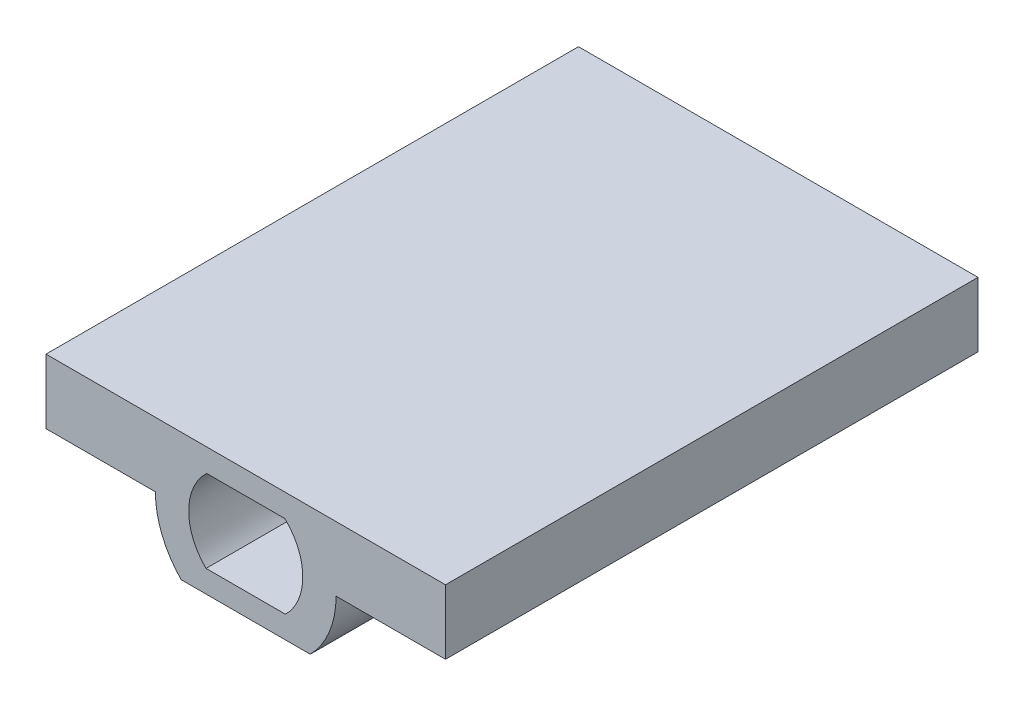
ISO-10303-21;
HEADER;
FILE_DESCRIPTION(('STEP AP214'),'2;1');
FILE_NAME('part.step','',(''),(''),'','','');
FILE_SCHEMA(('AUTOMOTIVE_DESIGN { 1 0 10303 214 1 1 1 1 }'));
ENDSEC;
DATA;
#1=APPLICATION_CONTEXT('core data for automotive mechanical design processes');
#2=APPLICATION_PROTOCOL_DEFINITION('international standard','automotive_design',2000,#1);
#3=PRODUCT_CONTEXT('',#1,'mechanical');
#4=PRODUCT('Part','Part','',(#3));
#5=PRODUCT_RELATED_PRODUCT_CATEGORY('part','',(#4));
#6=PRODUCT_DEFINITION_FORMATION('','',#4);
#7=PRODUCT_DEFINITION_CONTEXT('part definition',#1,'design');
#8=PRODUCT_DEFINITION('design','',#6,#7);
#9=PRODUCT_DEFINITION_SHAPE('','',#8);
#10=(LENGTH_UNIT() NAMED_UNIT(*) SI_UNIT(.MILLI.,.METRE.));
#11=(NAMED_UNIT(*) PLANE_ANGLE_UNIT() SI_UNIT($,.RADIAN.));
#12=(NAMED_UNIT(*) SI_UNIT($,.STERADIAN.) SOLID_ANGLE_UNIT());
#13=UNCERTAINTY_MEASURE_WITH_UNIT(LENGTH_MEASURE(1.E-05),#10,'distance_accuracy_value','');
#14=(GEOMETRIC_REPRESENTATION_CONTEXT(3) GLOBAL_UNCERTAINTY_ASSIGNED_CONTEXT((#13)) GLOBAL_UNIT_ASSIGNED_CONTEXT((#10,
#11,#12)) REPRESENTATION_CONTEXT('',''));
#15=CARTESIAN_POINT('',(0.,0.,0.));
#16=DIRECTION('',(0.,0.,1.));
#17=DIRECTION('',(1.,0.,0.));
#18=AXIS2_PLACEMENT_3D('',#15,#16,#17);
#19=CARTESIAN_POINT('',(0.,0.,-101.6));
#20=DIRECTION('',(0.,0.,1.));
#21=DIRECTION('',(1.,0.,0.));
#22=AXIS2_PLACEMENT_3D('',#19,#20,#21);
#23=CYLINDRICAL_SURFACE('',#22,17.2382279317392);
#24=CARTESIAN_POINT('',(0.,0.,0.));
#25=DIRECTION('',(0.,0.,1.));
#26=DIRECTION('',(1.,0.,0.));
#27=AXIS2_PLACEMENT_3D('',#24,#25,#26);
#28=CIRCLE('',#27,17.2382279317392);
#29=CARTESIAN_POINT('',(-17.2382279317392,0.,0.));
#30=VERTEX_POINT('',#29);
#31=CARTESIAN_POINT('',(-12.3122815605636,-12.065,0.));
#32=VERTEX_POINT('',#31);
#33=EDGE_CURVE('E167',#30,#32,#28,.T.);
#34=ORIENTED_EDGE('',*,*,#33,.F.);
#35=DIRECTION('',(0.,0.,1.));
#36=VECTOR('',#35,1.);
#37=CARTESIAN_POINT('',(-17.2382279317392,0.,-101.6));
#38=LINE('',#37,#36);
#39=CARTESIAN_POINT('',(-17.2382279317392,0.,-101.6));
#40=VERTEX_POINT('',#39);
#41=EDGE_CURVE('E45',#40,#30,#38,.T.);
#42=ORIENTED_EDGE('',*,*,#41,.F.);
#43=CARTESIAN_POINT('',(0.,0.,-101.6));
#44=DIRECTION('',(0.,0.,1.));
#45=DIRECTION('',(1.,0.,0.));
#46=AXIS2_PLACEMENT_3D('',#43,#44,#45);
#47=CIRCLE('',#46,17.2382279317392);
#48=CARTESIAN_POINT('',(-12.3122815605636,-12.065,-101.6));
#49=VERTEX_POINT('',#48);
#50=EDGE_CURVE('E185',#40,#49,#47,.T.);
#51=ORIENTED_EDGE('',*,*,#50,.T.);
#52=DIRECTION('',(0.,0.,1.));
#53=VECTOR('',#52,1.);
#54=CARTESIAN_POINT('',(-12.3122815605636,-12.065,-101.6));
#55=LINE('',#54,#53);
#56=EDGE_CURVE('E11',#49,#32,#55,.T.);
#57=ORIENTED_EDGE('',*,*,#56,.T.);
#58=EDGE_LOOP('',(#34,#42,#51,#57));
#59=FACE_BOUND('',#58,.T.);
#60=ADVANCED_FACE('F36',(#59),#23,.T.);
#61=CARTESIAN_POINT('',(-38.1093104455928,0.,-101.6));
#62=DIRECTION('',(0.,-1.,0.));
#63=DIRECTION('',(1.,0.,0.));
#64=AXIS2_PLACEMENT_3D('',#61,#62,#63);
#65=PLANE('',#64);
#66=DIRECTION('',(1.,0.,0.));
#67=VECTOR('',#66,1.);
#68=CARTESIAN_POINT('',(-38.1093104455928,0.,0.));
#69=LINE('',#68,#67);
#70=CARTESIAN_POINT('',(-38.1093104455928,0.,0.));
#71=VERTEX_POINT('',#70);
#72=EDGE_CURVE('E205',#71,#30,#69,.T.);
#73=ORIENTED_EDGE('',*,*,#72,.F.);
#74=DIRECTION('',(0.,0.,1.));
#75=VECTOR('',#74,1.);
#76=CARTESIAN_POINT('',(-38.1093104455928,0.,-101.6));
#77=LINE('',#76,#75);
#78=CARTESIAN_POINT('',(-38.1093104455928,0.,-101.6));
#79=VERTEX_POINT('',#78);
#80=EDGE_CURVE('E211',#79,#71,#77,.T.);
#81=ORIENTED_EDGE('',*,*,#80,.F.);
#82=DIRECTION('',(1.,0.,0.));
#83=VECTOR('',#82,1.);
#84=CARTESIAN_POINT('',(-38.1093104455928,0.,-101.6));
#85=LINE('',#84,#83);
#86=EDGE_CURVE('E182',#79,#40,#85,.T.);
#87=ORIENTED_EDGE('',*,*,#86,.T.);
#88=ORIENTED_EDGE('',*,*,#41,.T.);
#89=EDGE_LOOP('',(#73,#81,#87,#88));
#90=FACE_BOUND('',#89,.T.);
#91=ADVANCED_FACE('F250',(#90),#65,.T.);
#92=CARTESIAN_POINT('',(-38.1093104455928,0.,-101.6));
#93=DIRECTION('',(-1.,0.,0.));
#94=DIRECTION('',(0.,0.,1.));
#95=AXIS2_PLACEMENT_3D('',#92,#93,#94);
#96=PLANE('',#95);
#97=DIRECTION('',(0.,-1.,0.));
#98=VECTOR('',#97,1.);
#99=CARTESIAN_POINT('',(-38.1093104455928,0.,0.));
#100=LINE('',#99,#98);
#101=CARTESIAN_POINT('',(-38.1093104455928,12.319,0.));
#102=VERTEX_POINT('',#101);
#103=EDGE_CURVE('E202',#102,#71,#100,.T.);
#104=ORIENTED_EDGE('',*,*,#103,.F.);
#105=DIRECTION('',(0.,0.,1.));
#106=VECTOR('',#105,1.);
#107=CARTESIAN_POINT('',(-38.1093104455928,12.319,-101.6));
#108=LINE('',#107,#106);
#109=CARTESIAN_POINT('',(-38.1093104455928,12.319,-101.6));
#110=VERTEX_POINT('',#109);
#111=EDGE_CURVE('E213',#110,#102,#108,.T.);
#112=ORIENTED_EDGE('',*,*,#111,.F.);
#113=DIRECTION('',(0.,-1.,0.));
#114=VECTOR('',#113,1.);
#115=CARTESIAN_POINT('',(-38.1093104455928,0.,-101.6));
#116=LINE('',#115,#114);
#117=EDGE_CURVE('E179',#110,#79,#116,.T.);
#118=ORIENTED_EDGE('',*,*,#117,.T.);
#119=ORIENTED_EDGE('',*,*,#80,.T.);
#120=EDGE_LOOP('',(#104,#112,#118,#119));
#121=FACE_BOUND('',#120,.T.);
#122=ADVANCED_FACE('F248',(#121),#96,.T.);
#123=CARTESIAN_POINT('',(-38.1093104455928,12.319,-101.6));
#124=DIRECTION('',(0.,1.,0.));
#125=DIRECTION('',(0.,0.,1.));
#126=AXIS2_PLACEMENT_3D('',#123,#124,#125);
#127=PLANE('',#126);
#128=DIRECTION('',(-1.,0.,0.));
#129=VECTOR('',#128,1.);
#130=CARTESIAN_POINT('',(-38.1093104455928,12.319,0.));
#131=LINE('',#130,#129);
#132=CARTESIAN_POINT('',(38.1171655601355,12.319,0.));
#133=VERTEX_POINT('',#132);
#134=EDGE_CURVE('E199',#133,#102,#131,.T.);
#135=ORIENTED_EDGE('',*,*,#134,.F.);
#136=DIRECTION('',(0.,0.,1.));
#137=VECTOR('',#136,1.);
#138=CARTESIAN_POINT('',(38.1171655601355,12.319,-101.6));
#139=LINE('',#138,#137);
#140=CARTESIAN_POINT('',(38.1171655601355,12.319,-101.6));
#141=VERTEX_POINT('',#140);
#142=EDGE_CURVE('E215',#141,#133,#139,.T.);
#143=ORIENTED_EDGE('',*,*,#142,.F.);
#144=DIRECTION('',(-1.,0.,0.));
#145=VECTOR('',#144,1.);
#146=CARTESIAN_POINT('',(-38.1093104455928,12.319,-101.6));
#147=LINE('',#146,#145);
#148=EDGE_CURVE('E176',#141,#110,#147,.T.);
#149=ORIENTED_EDGE('',*,*,#148,.T.);
#150=ORIENTED_EDGE('',*,*,#111,.T.);
#151=EDGE_LOOP('',(#135,#143,#149,#150));
#152=FACE_BOUND('',#151,.T.);
#153=ADVANCED_FACE('F244',(#152),#127,.T.);
#154=CARTESIAN_POINT('',(38.1171655601355,12.319,-101.6));
#155=DIRECTION('',(1.,0.,0.));
#156=DIRECTION('',(0.,0.,-1.));
#157=AXIS2_PLACEMENT_3D('',#154,#155,#156);
#158=PLANE('',#157);
#159=DIRECTION('',(0.,1.,0.));
#160=VECTOR('',#159,1.);
#161=CARTESIAN_POINT('',(38.1171655601355,12.319,0.));
#162=LINE('',#161,#160);
#163=CARTESIAN_POINT('',(38.1171655601355,0.,0.));
#164=VERTEX_POINT('',#163);
#165=EDGE_CURVE('E196',#164,#133,#162,.T.);
#166=ORIENTED_EDGE('',*,*,#165,.F.);
#167=DIRECTION('',(0.,0.,1.));
#168=VECTOR('',#167,1.);
#169=CARTESIAN_POINT('',(38.1171655601355,0.,-101.6));
#170=LINE('',#169,#168);
#171=CARTESIAN_POINT('',(38.1171655601355,0.,-101.6));
#172=VERTEX_POINT('',#171);
#173=EDGE_CURVE('E217',#172,#164,#170,.T.);
#174=ORIENTED_EDGE('',*,*,#173,.F.);
#175=DIRECTION('',(0.,1.,0.));
#176=VECTOR('',#175,1.);
#177=CARTESIAN_POINT('',(38.1171655601355,12.319,-101.6));
#178=LINE('',#177,#176);
#179=EDGE_CURVE('E173',#172,#141,#178,.T.);
#180=ORIENTED_EDGE('',*,*,#179,.T.);
#181=ORIENTED_EDGE('',*,*,#142,.T.);
#182=EDGE_LOOP('',(#166,#174,#180,#181));
#183=FACE_BOUND('',#182,.T.);
#184=ADVANCED_FACE('F242',(#183),#158,.T.);
#185=CARTESIAN_POINT('',(17.2382279317392,0.,-101.6));
#186=DIRECTION('',(0.,-1.,0.));
#187=DIRECTION('',(1.,0.,0.));
#188=AXIS2_PLACEMENT_3D('',#185,#186,#187);
#189=PLANE('',#188);
#190=DIRECTION('',(1.,0.,0.));
#191=VECTOR('',#190,1.);
#192=CARTESIAN_POINT('',(17.2382279317392,0.,0.));
#193=LINE('',#192,#191);
#194=CARTESIAN_POINT('',(17.2382279317392,0.,0.));
#195=VERTEX_POINT('',#194);
#196=EDGE_CURVE('E193',#195,#164,#193,.T.);
#197=ORIENTED_EDGE('',*,*,#196,.F.);
#198=DIRECTION('',(0.,0.,1.));
#199=VECTOR('',#198,1.);
#200=CARTESIAN_POINT('',(17.2382279317392,0.,-101.6));
#201=LINE('',#200,#199);
#202=CARTESIAN_POINT('',(17.2382279317392,0.,-101.6));
#203=VERTEX_POINT('',#202);
#204=EDGE_CURVE('E218',#203,#195,#201,.T.);
#205=ORIENTED_EDGE('',*,*,#204,.F.);
#206=DIRECTION('',(1.,0.,0.));
#207=VECTOR('',#206,1.);
#208=CARTESIAN_POINT('',(17.2382279317392,0.,-101.6));
#209=LINE('',#208,#207);
#210=EDGE_CURVE('E170',#203,#172,#209,.T.);
#211=ORIENTED_EDGE('',*,*,#210,.T.);
#212=ORIENTED_EDGE('',*,*,#173,.T.);
#213=EDGE_LOOP('',(#197,#205,#211,#212));
#214=FACE_BOUND('',#213,.T.);
#215=ADVANCED_FACE('F238',(#214),#189,.T.);
#216=CARTESIAN_POINT('',(0.,0.,-101.6));
#217=DIRECTION('',(0.,0.,1.));
#218=DIRECTION('',(1.,0.,0.));
#219=AXIS2_PLACEMENT_3D('',#216,#217,#218);
#220=CYLINDRICAL_SURFACE('',#219,17.2382279317392);
#221=CARTESIAN_POINT('',(0.,0.,0.));
#222=DIRECTION('',(0.,0.,1.));
#223=DIRECTION('',(1.,0.,0.));
#224=AXIS2_PLACEMENT_3D('',#221,#222,#223);
#225=CIRCLE('',#224,17.2382279317392);
#226=CARTESIAN_POINT('',(12.3122815605636,-12.065,0.));
#227=VERTEX_POINT('',#226);
#228=EDGE_CURVE('E190',#227,#195,#225,.T.);
#229=ORIENTED_EDGE('',*,*,#228,.F.);
#230=DIRECTION('',(0.,0.,1.));
#231=VECTOR('',#230,1.);
#232=CARTESIAN_POINT('',(12.3122815605636,-12.065,-101.6));
#233=LINE('',#232,#231);
#234=CARTESIAN_POINT('',(12.3122815605636,-12.065,-101.6));
#235=VERTEX_POINT('',#234);
#236=EDGE_CURVE('E40',#235,#227,#233,.T.);
#237=ORIENTED_EDGE('',*,*,#236,.F.);
#238=CARTESIAN_POINT('',(0.,0.,-101.6));
#239=DIRECTION('',(0.,0.,1.));
#240=DIRECTION('',(1.,0.,0.));
#241=AXIS2_PLACEMENT_3D('',#238,#239,#240);
#242=CIRCLE('',#241,17.2382279317392);
#243=EDGE_CURVE('E166',#235,#203,#242,.T.);
#244=ORIENTED_EDGE('',*,*,#243,.T.);
#245=ORIENTED_EDGE('',*,*,#204,.T.);
#246=EDGE_LOOP('',(#229,#237,#244,#245));
#247=FACE_BOUND('',#246,.T.);
#248=ADVANCED_FACE('F226',(#247),#220,.T.);
#249=CARTESIAN_POINT('',(12.0581400400971,-12.065,-101.6));
#250=DIRECTION('',(0.,-1.,0.));
#251=DIRECTION('',(0.,0.,-1.));
#252=AXIS2_PLACEMENT_3D('',#249,#250,#251);
#253=PLANE('',#252);
#254=DIRECTION('',(1.,0.,0.));
#255=VECTOR('',#254,1.);
#256=CARTESIAN_POINT('',(12.0581400400971,-12.065,0.));
#257=LINE('',#256,#255);
#258=EDGE_CURVE('E160',#32,#227,#257,.T.);
#259=ORIENTED_EDGE('',*,*,#258,.F.);
#260=ORIENTED_EDGE('',*,*,#56,.F.);
#261=DIRECTION('',(1.,0.,0.));
#262=VECTOR('',#261,1.);
#263=CARTESIAN_POINT('',(-12.0581400400971,-12.065,-101.6));
#264=LINE('',#263,#262);
#265=EDGE_CURVE('E164',#49,#235,#264,.T.);
#266=ORIENTED_EDGE('',*,*,#265,.T.);
#267=ORIENTED_EDGE('',*,*,#236,.T.);
#268=EDGE_LOOP('',(#259,#260,#266,#267));
#269=FACE_BOUND('',#268,.T.);
#270=ADVANCED_FACE('F38',(#269),#253,.T.);
#271=CARTESIAN_POINT('',(0.,0.,-101.6));
#272=DIRECTION('',(0.,0.,1.));
#273=DIRECTION('',(1.,0.,0.));
#274=AXIS2_PLACEMENT_3D('',#271,#272,#273);
#275=PLANE('',#274);
#276=DIRECTION('',(1.,0.,0.));
#277=VECTOR('',#276,1.);
#278=CARTESIAN_POINT('',(-7.57553708610134,-7.8207893048342,-101.6));
#279=LINE('',#278,#277);
#280=CARTESIAN_POINT('',(-7.57553708610134,-7.8207893048342,-101.6));
#281=VERTEX_POINT('',#280);
#282=CARTESIAN_POINT('',(7.57553708610134,-7.8207893048342,-101.6));
#283=VERTEX_POINT('',#282);
#284=EDGE_CURVE('E135',#281,#283,#279,.T.);
#285=ORIENTED_EDGE('',*,*,#284,.T.);
#286=CARTESIAN_POINT('',(0.,0.,-101.6));
#287=DIRECTION('',(0.,0.,1.));
#288=DIRECTION('',(1.,0.,0.));
#289=AXIS2_PLACEMENT_3D('',#286,#287,#288);
#290=CIRCLE('',#289,10.8882279317392);
#291=CARTESIAN_POINT('',(7.45950180664031,7.93154085220746,-101.6));
#292=VERTEX_POINT('',#291);
#293=EDGE_CURVE('E129',#283,#292,#290,.T.);
#294=ORIENTED_EDGE('',*,*,#293,.T.);
#295=DIRECTION('',(-1.,0.,0.));
#296=VECTOR('',#295,1.);
#297=CARTESIAN_POINT('',(-7.45950180664031,7.93154085220746,-101.6));
#298=LINE('',#297,#296);
#299=CARTESIAN_POINT('',(-7.45950180664031,7.93154085220746,-101.6));
#300=VERTEX_POINT('',#299);
#301=EDGE_CURVE('E138',#292,#300,#298,.T.);
#302=ORIENTED_EDGE('',*,*,#301,.T.);
#303=CARTESIAN_POINT('',(0.,0.,-101.6));
#304=DIRECTION('',(0.,0.,1.));
#305=DIRECTION('',(1.,0.,0.));
#306=AXIS2_PLACEMENT_3D('',#303,#304,#305);
#307=CIRCLE('',#306,10.8882279317392);
#308=EDGE_CURVE('E53',#300,#281,#307,.T.);
#309=ORIENTED_EDGE('',*,*,#308,.T.);
#310=EDGE_LOOP('',(#285,#294,#302,#309));
#311=FACE_BOUND('',#310,.T.);
#312=ORIENTED_EDGE('',*,*,#265,.F.);
#313=ORIENTED_EDGE('',*,*,#50,.F.);
#314=ORIENTED_EDGE('',*,*,#86,.F.);
#315=ORIENTED_EDGE('',*,*,#117,.F.);
#316=ORIENTED_EDGE('',*,*,#148,.F.);
#317=ORIENTED_EDGE('',*,*,#179,.F.);
#318=ORIENTED_EDGE('',*,*,#210,.F.);
#319=ORIENTED_EDGE('',*,*,#243,.F.);
#320=EDGE_LOOP('',(#312,#313,#314,#315,#316,#317,#318,#319));
#321=FACE_BOUND('',#320,.T.);
#322=ADVANCED_FACE('F142',(#311,#321),#275,.F.);
#323=CARTESIAN_POINT('',(0.,0.,0.));
#324=DIRECTION('',(0.,0.,1.));
#325=DIRECTION('',(1.,0.,0.));
#326=AXIS2_PLACEMENT_3D('',#323,#324,#325);
#327=PLANE('',#326);
#328=CARTESIAN_POINT('',(0.,0.,0.));
#329=DIRECTION('',(0.,0.,1.));
#330=DIRECTION('',(1.,0.,0.));
#331=AXIS2_PLACEMENT_3D('',#328,#329,#330);
#332=CIRCLE('',#331,10.8882279317392);
#333=CARTESIAN_POINT('',(7.57553708610134,-7.8207893048342,0.));
#334=VERTEX_POINT('',#333);
#335=CARTESIAN_POINT('',(7.45950180664031,7.93154085220746,0.));
#336=VERTEX_POINT('',#335);
#337=EDGE_CURVE('E61',#334,#336,#332,.T.);
#338=ORIENTED_EDGE('',*,*,#337,.F.);
#339=DIRECTION('',(1.,0.,0.));
#340=VECTOR('',#339,1.);
#341=CARTESIAN_POINT('',(-7.57553708610134,-7.8207893048342,0.));
#342=LINE('',#341,#340);
#343=CARTESIAN_POINT('',(-7.57553708610134,-7.8207893048342,0.));
#344=VERTEX_POINT('',#343);
#345=EDGE_CURVE('E145',#344,#334,#342,.T.);
#346=ORIENTED_EDGE('',*,*,#345,.F.);
#347=CARTESIAN_POINT('',(0.,0.,0.));
#348=DIRECTION('',(0.,0.,1.));
#349=DIRECTION('',(1.,0.,0.));
#350=AXIS2_PLACEMENT_3D('',#347,#348,#349);
#351=CIRCLE('',#350,10.8882279317392);
#352=CARTESIAN_POINT('',(-7.45950180664031,7.93154085220745,0.));
#353=VERTEX_POINT('',#352);
#354=EDGE_CURVE('E148',#353,#344,#351,.T.);
#355=ORIENTED_EDGE('',*,*,#354,.F.);
#356=DIRECTION('',(-1.,0.,0.));
#357=VECTOR('',#356,1.);
#358=CARTESIAN_POINT('',(-7.45950180664031,7.93154085220746,0.));
#359=LINE('',#358,#357);
#360=EDGE_CURVE('E154',#336,#353,#359,.T.);
#361=ORIENTED_EDGE('',*,*,#360,.F.);
#362=EDGE_LOOP('',(#338,#346,#355,#361));
#363=FACE_BOUND('',#362,.T.);
#364=ORIENTED_EDGE('',*,*,#33,.T.);
#365=ORIENTED_EDGE('',*,*,#258,.T.);
#366=ORIENTED_EDGE('',*,*,#228,.T.);
#367=ORIENTED_EDGE('',*,*,#196,.T.);
#368=ORIENTED_EDGE('',*,*,#165,.T.);
#369=ORIENTED_EDGE('',*,*,#134,.T.);
#370=ORIENTED_EDGE('',*,*,#103,.T.);
#371=ORIENTED_EDGE('',*,*,#72,.T.);
#372=EDGE_LOOP('',(#364,#365,#366,#367,#368,#369,#370,#371));
#373=FACE_BOUND('',#372,.T.);
#374=ADVANCED_FACE('F228',(#363,#373),#327,.T.);
#375=CARTESIAN_POINT('',(0.,0.,-101.6));
#376=DIRECTION('',(0.,0.,1.));
#377=DIRECTION('',(1.,0.,0.));
#378=AXIS2_PLACEMENT_3D('',#375,#376,#377);
#379=CYLINDRICAL_SURFACE('',#378,10.8882279317392);
#380=ORIENTED_EDGE('',*,*,#337,.T.);
#381=DIRECTION('',(0.,0.,1.));
#382=VECTOR('',#381,1.);
#383=CARTESIAN_POINT('',(7.45950180664031,7.93154085220746,-101.6));
#384=LINE('',#383,#382);
#385=EDGE_CURVE('E125',#292,#336,#384,.T.);
#386=ORIENTED_EDGE('',*,*,#385,.F.);
#387=ORIENTED_EDGE('',*,*,#293,.F.);
#388=DIRECTION('',(0.,0.,1.));
#389=VECTOR('',#388,1.);
#390=CARTESIAN_POINT('',(7.57553708610134,-7.8207893048342,-101.6));
#391=LINE('',#390,#389);
#392=EDGE_CURVE('E158',#283,#334,#391,.T.);
#393=ORIENTED_EDGE('',*,*,#392,.T.);
#394=EDGE_LOOP('',(#380,#386,#387,#393));
#395=FACE_BOUND('',#394,.T.);
#396=ADVANCED_FACE('F127',(#395),#379,.F.);
#397=CARTESIAN_POINT('',(-7.57553708610134,-7.8207893048342,-101.6));
#398=DIRECTION('',(0.,-1.,0.));
#399=DIRECTION('',(0.,0.,-1.));
#400=AXIS2_PLACEMENT_3D('',#397,#398,#399);
#401=PLANE('',#400);
#402=ORIENTED_EDGE('',*,*,#345,.T.);
#403=ORIENTED_EDGE('',*,*,#392,.F.);
#404=ORIENTED_EDGE('',*,*,#284,.F.);
#405=DIRECTION('',(0.,0.,1.));
#406=VECTOR('',#405,1.);
#407=CARTESIAN_POINT('',(-7.57553708610134,-7.8207893048342,-101.6));
#408=LINE('',#407,#406);
#409=EDGE_CURVE('E161',#281,#344,#408,.T.);
#410=ORIENTED_EDGE('',*,*,#409,.T.);
#411=EDGE_LOOP('',(#402,#403,#404,#410));
#412=FACE_BOUND('',#411,.T.);
#413=ADVANCED_FACE('F281',(#412),#401,.F.);
#414=CARTESIAN_POINT('',(0.,0.,-101.6));
#415=DIRECTION('',(0.,0.,1.));
#416=DIRECTION('',(1.,0.,0.));
#417=AXIS2_PLACEMENT_3D('',#414,#415,#416);
#418=CYLINDRICAL_SURFACE('',#417,10.8882279317392);
#419=ORIENTED_EDGE('',*,*,#354,.T.);
#420=ORIENTED_EDGE('',*,*,#409,.F.);
#421=ORIENTED_EDGE('',*,*,#308,.F.);
#422=DIRECTION('',(0.,0.,1.));
#423=VECTOR('',#422,1.);
#424=CARTESIAN_POINT('',(-7.45950180664031,7.93154085220745,-101.6));
#425=LINE('',#424,#423);
#426=EDGE_CURVE('E134',#300,#353,#425,.T.);
#427=ORIENTED_EDGE('',*,*,#426,.T.);
#428=EDGE_LOOP('',(#419,#420,#421,#427));
#429=FACE_BOUND('',#428,.T.);
#430=ADVANCED_FACE('F284',(#429),#418,.F.);
#431=CARTESIAN_POINT('',(-7.45950180664031,7.93154085220746,-101.6));
#432=DIRECTION('',(0.,1.,0.));
#433=DIRECTION('',(0.,0.,1.));
#434=AXIS2_PLACEMENT_3D('',#431,#432,#433);
#435=PLANE('',#434);
#436=ORIENTED_EDGE('',*,*,#360,.T.);
#437=ORIENTED_EDGE('',*,*,#426,.F.);
#438=ORIENTED_EDGE('',*,*,#301,.F.);
#439=ORIENTED_EDGE('',*,*,#385,.T.);
#440=EDGE_LOOP('',(#436,#437,#438,#439));
#441=FACE_BOUND('',#440,.T.);
#442=ADVANCED_FACE('F139',(#441),#435,.F.);
#443=CLOSED_SHELL('',(#60,#91,#122,#153,#184,#215,#248,#270,#322,#374,#396,#413,#430,#442));
#444=MANIFOLD_SOLID_BREP('B2',#443);
#445=ADVANCED_BREP_SHAPE_REPRESENTATION('',(#18,#444),#14);
#446=SHAPE_DEFINITION_REPRESENTATION(#9,#445);
ENDSEC;
END-ISO-10303-21;
